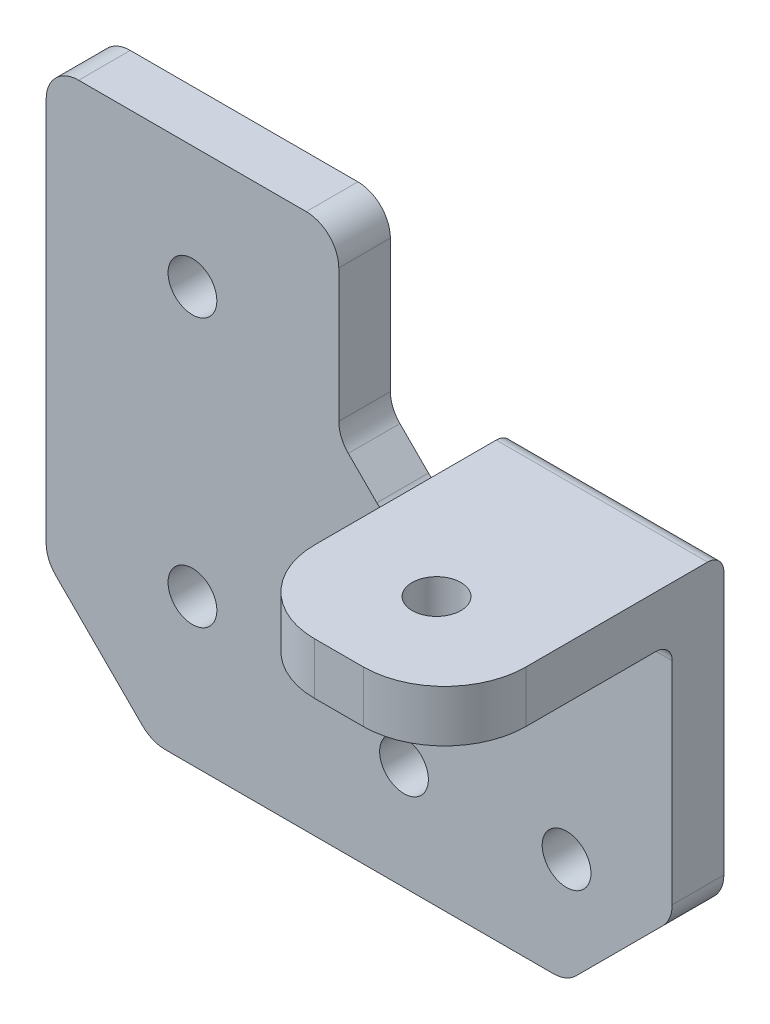
ISO-10303-21;
HEADER;
FILE_DESCRIPTION(('STEP AP214'),'2;1');
FILE_NAME('part.step','',(''),(''),'','','');
FILE_SCHEMA(('AUTOMOTIVE_DESIGN { 1 0 10303 214 1 1 1 1 }'));
ENDSEC;
DATA;
#1=APPLICATION_CONTEXT('core data for automotive mechanical design processes');
#2=APPLICATION_PROTOCOL_DEFINITION('international standard','automotive_design',2000,#1);
#3=PRODUCT_CONTEXT('',#1,'mechanical');
#4=PRODUCT('Part','Part','',(#3));
#5=PRODUCT_RELATED_PRODUCT_CATEGORY('part','',(#4));
#6=PRODUCT_DEFINITION_FORMATION('','',#4);
#7=PRODUCT_DEFINITION_CONTEXT('part definition',#1,'design');
#8=PRODUCT_DEFINITION('design','',#6,#7);
#9=PRODUCT_DEFINITION_SHAPE('','',#8);
#10=(LENGTH_UNIT() NAMED_UNIT(*) SI_UNIT(.MILLI.,.METRE.));
#11=(NAMED_UNIT(*) PLANE_ANGLE_UNIT() SI_UNIT($,.RADIAN.));
#12=(NAMED_UNIT(*) SI_UNIT($,.STERADIAN.) SOLID_ANGLE_UNIT());
#13=UNCERTAINTY_MEASURE_WITH_UNIT(LENGTH_MEASURE(1.E-05),#10,'distance_accuracy_value','');
#14=(GEOMETRIC_REPRESENTATION_CONTEXT(3) GLOBAL_UNCERTAINTY_ASSIGNED_CONTEXT((#13)) GLOBAL_UNIT_ASSIGNED_CONTEXT((#10,
#11,#12)) REPRESENTATION_CONTEXT('',''));
#15=CARTESIAN_POINT('',(0.,0.,0.));
#16=DIRECTION('',(0.,0.,1.));
#17=DIRECTION('',(1.,0.,0.));
#18=AXIS2_PLACEMENT_3D('',#15,#16,#17);
#19=CARTESIAN_POINT('',(6.5,0.,3.175));
#20=DIRECTION('',(1.,0.,0.));
#21=DIRECTION('',(0.,0.,-1.));
#22=AXIS2_PLACEMENT_3D('',#19,#20,#21);
#23=PLANE('',#22);
#24=DIRECTION('',(0.,-1.,0.));
#25=VECTOR('',#24,1.);
#26=CARTESIAN_POINT('',(6.5,0.,3.175));
#27=LINE('',#26,#25);
#28=CARTESIAN_POINT('',(6.5,13.825,3.175));
#29=VERTEX_POINT('',#28);
#30=CARTESIAN_POINT('',(6.5,0.82842712474619,3.175));
#31=VERTEX_POINT('',#30);
#32=EDGE_CURVE('E269',#29,#31,#27,.T.);
#33=ORIENTED_EDGE('',*,*,#32,.T.);
#34=DIRECTION('',(0.,0.,-1.));
#35=VECTOR('',#34,1.);
#36=CARTESIAN_POINT('',(6.5,0.82842712474619,0.));
#37=LINE('',#36,#35);
#38=CARTESIAN_POINT('',(6.5,0.82842712474619,0.));
#39=VERTEX_POINT('',#38);
#40=EDGE_CURVE('E374',#31,#39,#37,.T.);
#41=ORIENTED_EDGE('',*,*,#40,.T.);
#42=DIRECTION('',(0.,-1.,0.));
#43=VECTOR('',#42,1.);
#44=CARTESIAN_POINT('',(6.5,0.,0.));
#45=LINE('',#44,#43);
#46=CARTESIAN_POINT('',(6.5,17.,0.));
#47=VERTEX_POINT('',#46);
#48=EDGE_CURVE('E278',#47,#39,#45,.T.);
#49=ORIENTED_EDGE('',*,*,#48,.F.);
#50=CARTESIAN_POINT('',(6.5,17.,1.));
#51=DIRECTION('',(1.,0.,0.));
#52=DIRECTION('',(0.,0.,-1.));
#53=AXIS2_PLACEMENT_3D('',#50,#51,#52);
#54=CIRCLE('',#53,1.);
#55=CARTESIAN_POINT('',(6.5,18.,1.));
#56=VERTEX_POINT('',#55);
#57=EDGE_CURVE('E310',#47,#56,#54,.T.);
#58=ORIENTED_EDGE('',*,*,#57,.T.);
#59=DIRECTION('',(0.,0.,-1.));
#60=VECTOR('',#59,1.);
#61=CARTESIAN_POINT('',(6.5,18.,3.175));
#62=LINE('',#61,#60);
#63=CARTESIAN_POINT('',(6.5,18.,12.175));
#64=VERTEX_POINT('',#63);
#65=EDGE_CURVE('E287',#64,#56,#62,.T.);
#66=ORIENTED_EDGE('',*,*,#65,.F.);
#67=DIRECTION('',(0.,1.,0.));
#68=VECTOR('',#67,1.);
#69=CARTESIAN_POINT('',(6.5,0.,12.175));
#70=LINE('',#69,#68);
#71=CARTESIAN_POINT('',(6.5,14.825,12.175));
#72=VERTEX_POINT('',#71);
#73=EDGE_CURVE('E303',#64,#72,#70,.F.);
#74=ORIENTED_EDGE('',*,*,#73,.T.);
#75=DIRECTION('',(0.,0.,-1.));
#76=VECTOR('',#75,1.);
#77=CARTESIAN_POINT('',(6.5,14.825,17.175));
#78=LINE('',#77,#76);
#79=CARTESIAN_POINT('',(6.5,14.825,4.175));
#80=VERTEX_POINT('',#79);
#81=EDGE_CURVE('E250',#72,#80,#78,.T.);
#82=ORIENTED_EDGE('',*,*,#81,.T.);
#83=CARTESIAN_POINT('',(6.5,13.825,4.175));
#84=DIRECTION('',(1.,0.,0.));
#85=DIRECTION('',(0.,0.,-1.));
#86=AXIS2_PLACEMENT_3D('',#83,#84,#85);
#87=CIRCLE('',#86,1.);
#88=EDGE_CURVE('E328',#80,#29,#87,.F.);
#89=ORIENTED_EDGE('',*,*,#88,.T.);
#90=EDGE_LOOP('',(#33,#41,#49,#58,#66,#74,#82,#89));
#91=FACE_BOUND('',#90,.T.);
#92=ADVANCED_FACE('F41',(#91),#23,.T.);
#93=CARTESIAN_POINT('',(0.,18.,3.175));
#94=DIRECTION('',(0.,1.,0.));
#95=DIRECTION('',(0.,0.,1.));
#96=AXIS2_PLACEMENT_3D('',#93,#94,#95);
#97=PLANE('',#96);
#98=CARTESIAN_POINT('',(0.,18.,11.175));
#99=DIRECTION('',(0.,1.,0.));
#100=DIRECTION('',(0.,0.,1.));
#101=AXIS2_PLACEMENT_3D('',#98,#99,#100);
#102=CIRCLE('',#101,1.5);
#103=CARTESIAN_POINT('',(0.,18.,12.675));
#104=VERTEX_POINT('',#103);
#105=EDGE_CURVE('E253',#104,#104,#102,.T.);
#106=ORIENTED_EDGE('',*,*,#105,.F.);
#107=EDGE_LOOP('',(#106));
#108=FACE_BOUND('',#107,.T.);
#109=ORIENTED_EDGE('',*,*,#65,.T.);
#110=DIRECTION('',(1.,0.,0.));
#111=VECTOR('',#110,1.);
#112=CARTESIAN_POINT('',(-6.5,18.,1.));
#113=LINE('',#112,#111);
#114=CARTESIAN_POINT('',(-6.5,18.,1.));
#115=VERTEX_POINT('',#114);
#116=EDGE_CURVE('E313',#56,#115,#113,.F.);
#117=ORIENTED_EDGE('',*,*,#116,.T.);
#118=DIRECTION('',(0.,0.,-1.));
#119=VECTOR('',#118,1.);
#120=CARTESIAN_POINT('',(-6.5,18.,3.175));
#121=LINE('',#120,#119);
#122=CARTESIAN_POINT('',(-6.5,18.,12.175));
#123=VERTEX_POINT('',#122);
#124=EDGE_CURVE('E274',#123,#115,#121,.T.);
#125=ORIENTED_EDGE('',*,*,#124,.F.);
#126=CARTESIAN_POINT('',(-1.5,18.,12.175));
#127=DIRECTION('',(0.,1.,0.));
#128=DIRECTION('',(0.,0.,1.));
#129=AXIS2_PLACEMENT_3D('',#126,#127,#128);
#130=CIRCLE('',#129,5.);
#131=CARTESIAN_POINT('',(-1.5,18.,17.175));
#132=VERTEX_POINT('',#131);
#133=EDGE_CURVE('E300',#123,#132,#130,.T.);
#134=ORIENTED_EDGE('',*,*,#133,.T.);
#135=DIRECTION('',(-1.,0.,0.));
#136=VECTOR('',#135,1.);
#137=CARTESIAN_POINT('',(-6.5,18.,17.175));
#138=LINE('',#137,#136);
#139=CARTESIAN_POINT('',(1.5,18.,17.175));
#140=VERTEX_POINT('',#139);
#141=EDGE_CURVE('E238',#140,#132,#138,.T.);
#142=ORIENTED_EDGE('',*,*,#141,.F.);
#143=CARTESIAN_POINT('',(1.5,18.,12.175));
#144=DIRECTION('',(0.,1.,0.));
#145=DIRECTION('',(0.,0.,1.));
#146=AXIS2_PLACEMENT_3D('',#143,#144,#145);
#147=CIRCLE('',#146,5.);
#148=EDGE_CURVE('E297',#140,#64,#147,.T.);
#149=ORIENTED_EDGE('',*,*,#148,.T.);
#150=EDGE_LOOP('',(#109,#117,#125,#134,#142,#149));
#151=FACE_BOUND('',#150,.T.);
#152=ADVANCED_FACE('F573',(#108,#151),#97,.T.);
#153=CARTESIAN_POINT('',(0.,0.,3.175));
#154=DIRECTION('',(0.,0.,-1.));
#155=DIRECTION('',(-1.,0.,0.));
#156=AXIS2_PLACEMENT_3D('',#153,#154,#155);
#157=CYLINDRICAL_SURFACE('',#156,1.5);
#158=CARTESIAN_POINT('',(0.,0.,3.175));
#159=DIRECTION('',(0.,0.,1.));
#160=DIRECTION('',(1.,0.,0.));
#161=AXIS2_PLACEMENT_3D('',#158,#159,#160);
#162=CIRCLE('',#161,1.5);
#163=CARTESIAN_POINT('',(1.5,0.,3.175));
#164=VERTEX_POINT('',#163);
#165=EDGE_CURVE('E265',#164,#164,#162,.T.);
#166=ORIENTED_EDGE('',*,*,#165,.T.);
#167=EDGE_LOOP('',(#166));
#168=FACE_BOUND('',#167,.T.);
#169=CARTESIAN_POINT('',(0.,0.,0.));
#170=DIRECTION('',(0.,0.,1.));
#171=DIRECTION('',(1.,0.,0.));
#172=AXIS2_PLACEMENT_3D('',#169,#170,#171);
#173=CIRCLE('',#172,1.5);
#174=CARTESIAN_POINT('',(1.5,0.,0.));
#175=VERTEX_POINT('',#174);
#176=EDGE_CURVE('E264',#175,#175,#173,.T.);
#177=ORIENTED_EDGE('',*,*,#176,.F.);
#178=EDGE_LOOP('',(#177));
#179=FACE_BOUND('',#178,.T.);
#180=ADVANCED_FACE('F579',(#168,#179),#157,.F.);
#181=CARTESIAN_POINT('',(-6.5,0.,3.175));
#182=DIRECTION('',(-1.,0.,0.));
#183=DIRECTION('',(0.,0.,1.));
#184=AXIS2_PLACEMENT_3D('',#181,#182,#183);
#185=PLANE('',#184);
#186=DIRECTION('',(0.,1.,0.));
#187=VECTOR('',#186,1.);
#188=CARTESIAN_POINT('',(-6.5,0.,0.));
#189=LINE('',#188,#187);
#190=CARTESIAN_POINT('',(-6.5,16.3284271247462,0.));
#191=VERTEX_POINT('',#190);
#192=CARTESIAN_POINT('',(-6.5,17.,0.));
#193=VERTEX_POINT('',#192);
#194=EDGE_CURVE('E270',#191,#193,#189,.T.);
#195=ORIENTED_EDGE('',*,*,#194,.F.);
#196=DIRECTION('',(0.,0.,-1.));
#197=VECTOR('',#196,1.);
#198=CARTESIAN_POINT('',(-6.5,16.3284271247462,3.175));
#199=LINE('',#198,#197);
#200=CARTESIAN_POINT('',(-6.5,16.3284271247462,3.175));
#201=VERTEX_POINT('',#200);
#202=EDGE_CURVE('E348',#191,#201,#199,.F.);
#203=ORIENTED_EDGE('',*,*,#202,.T.);
#204=DIRECTION('',(0.,-1.,0.));
#205=VECTOR('',#204,1.);
#206=CARTESIAN_POINT('',(-6.5,0.,3.175));
#207=LINE('',#206,#205);
#208=CARTESIAN_POINT('',(-6.5,13.825,3.175));
#209=VERTEX_POINT('',#208);
#210=EDGE_CURVE('E334',#201,#209,#207,.T.);
#211=ORIENTED_EDGE('',*,*,#210,.T.);
#212=CARTESIAN_POINT('',(-6.5,13.825,4.175));
#213=DIRECTION('',(-1.,0.,0.));
#214=DIRECTION('',(0.,0.,1.));
#215=AXIS2_PLACEMENT_3D('',#212,#213,#214);
#216=CIRCLE('',#215,1.);
#217=CARTESIAN_POINT('',(-6.5,14.825,4.175));
#218=VERTEX_POINT('',#217);
#219=EDGE_CURVE('E331',#209,#218,#216,.F.);
#220=ORIENTED_EDGE('',*,*,#219,.T.);
#221=DIRECTION('',(0.,0.,-1.));
#222=VECTOR('',#221,1.);
#223=CARTESIAN_POINT('',(-6.5,14.825,17.175));
#224=LINE('',#223,#222);
#225=CARTESIAN_POINT('',(-6.5,14.825,12.175));
#226=VERTEX_POINT('',#225);
#227=EDGE_CURVE('E261',#226,#218,#224,.T.);
#228=ORIENTED_EDGE('',*,*,#227,.F.);
#229=DIRECTION('',(0.,-1.,0.));
#230=VECTOR('',#229,1.);
#231=CARTESIAN_POINT('',(-6.5,0.,12.175));
#232=LINE('',#231,#230);
#233=EDGE_CURVE('E222',#226,#123,#232,.F.);
#234=ORIENTED_EDGE('',*,*,#233,.T.);
#235=ORIENTED_EDGE('',*,*,#124,.T.);
#236=CARTESIAN_POINT('',(-6.5,17.,1.));
#237=DIRECTION('',(-1.,0.,0.));
#238=DIRECTION('',(0.,0.,1.));
#239=AXIS2_PLACEMENT_3D('',#236,#237,#238);
#240=CIRCLE('',#239,1.);
#241=EDGE_CURVE('E316',#115,#193,#240,.T.);
#242=ORIENTED_EDGE('',*,*,#241,.T.);
#243=EDGE_LOOP('',(#195,#203,#211,#220,#228,#234,#235,#242));
#244=FACE_BOUND('',#243,.T.);
#245=ADVANCED_FACE('F567',(#244),#185,.T.);
#246=CARTESIAN_POINT('',(0.,0.,3.175));
#247=DIRECTION('',(0.,0.,1.));
#248=DIRECTION('',(1.,0.,0.));
#249=AXIS2_PLACEMENT_3D('',#246,#247,#248);
#250=PLANE('',#249);
#251=CARTESIAN_POINT('',(-23.0129229130923,2.50000000000004,3.175));
#252=DIRECTION('',(0.,0.,-1.));
#253=DIRECTION('',(-1.,0.,0.));
#254=AXIS2_PLACEMENT_3D('',#251,#252,#253);
#255=CIRCLE('',#254,1.5);
#256=CARTESIAN_POINT('',(-24.5129229130923,2.50000000000004,3.175));
#257=VERTEX_POINT('',#256);
#258=EDGE_CURVE('E484',#257,#257,#255,.T.);
#259=ORIENTED_EDGE('',*,*,#258,.T.);
#260=EDGE_LOOP('',(#259));
#261=FACE_BOUND('',#260,.T.);
#262=CARTESIAN_POINT('',(-23.0129229130923,19.,3.175));
#263=DIRECTION('',(0.,0.,1.));
#264=DIRECTION('',(1.,0.,0.));
#265=AXIS2_PLACEMENT_3D('',#262,#263,#264);
#266=CIRCLE('',#265,1.5);
#267=CARTESIAN_POINT('',(-21.5129229130923,19.,3.175));
#268=VERTEX_POINT('',#267);
#269=EDGE_CURVE('E547',#268,#268,#266,.T.);
#270=ORIENTED_EDGE('',*,*,#269,.F.);
#271=EDGE_LOOP('',(#270));
#272=FACE_BOUND('',#271,.T.);
#273=DIRECTION('',(0.,1.,0.));
#274=VECTOR('',#273,1.);
#275=CARTESIAN_POINT('',(-32.0129229130922,0.,3.175));
#276=LINE('',#275,#274);
#277=CARTESIAN_POINT('',(-32.0129229130922,0.828427124746165,3.175));
#278=VERTEX_POINT('',#277);
#279=CARTESIAN_POINT('',(-32.0129229130922,24.5,3.175));
#280=VERTEX_POINT('',#279);
#281=EDGE_CURVE('E483',#278,#280,#276,.T.);
#282=ORIENTED_EDGE('',*,*,#281,.F.);
#283=CARTESIAN_POINT('',(-30.0129229130922,0.828427124746165,3.175));
#284=DIRECTION('',(0.,0.,1.));
#285=DIRECTION('',(1.,0.,0.));
#286=AXIS2_PLACEMENT_3D('',#283,#284,#285);
#287=CIRCLE('',#286,2.);
#288=CARTESIAN_POINT('',(-31.4271364754653,-0.585786437626929,3.175));
#289=VERTEX_POINT('',#288);
#290=EDGE_CURVE('E459',#278,#289,#287,.T.);
#291=ORIENTED_EDGE('',*,*,#290,.T.);
#292=DIRECTION('',(-0.707106781186547,0.707106781186548,0.));
#293=VECTOR('',#292,1.);
#294=CARTESIAN_POINT('',(-16.0064614565462,-16.0064614565461,3.175));
#295=LINE('',#294,#293);
#296=CARTESIAN_POINT('',(-26.0987093507192,-5.9142135623731,3.175));
#297=VERTEX_POINT('',#296);
#298=EDGE_CURVE('E448',#289,#297,#295,.F.);
#299=ORIENTED_EDGE('',*,*,#298,.T.);
#300=CARTESIAN_POINT('',(-24.6844957883461,-4.5,3.175));
#301=DIRECTION('',(0.,0.,1.));
#302=DIRECTION('',(1.,0.,0.));
#303=AXIS2_PLACEMENT_3D('',#300,#301,#302);
#304=CIRCLE('',#303,2.);
#305=CARTESIAN_POINT('',(-24.6844957883461,-6.5,3.175));
#306=VERTEX_POINT('',#305);
#307=EDGE_CURVE('E456',#297,#306,#304,.T.);
#308=ORIENTED_EDGE('',*,*,#307,.T.);
#309=DIRECTION('',(-1.,0.,0.));
#310=VECTOR('',#309,1.);
#311=CARTESIAN_POINT('',(0.,-6.5,3.175));
#312=LINE('',#311,#310);
#313=CARTESIAN_POINT('',(-0.82842712474619,-6.5,3.175));
#314=VERTEX_POINT('',#313);
#315=EDGE_CURVE('E494',#314,#306,#312,.T.);
#316=ORIENTED_EDGE('',*,*,#315,.F.);
#317=CARTESIAN_POINT('',(-0.82842712474619,-4.5,3.175));
#318=DIRECTION('',(0.,0.,1.));
#319=DIRECTION('',(1.,0.,0.));
#320=AXIS2_PLACEMENT_3D('',#317,#318,#319);
#321=CIRCLE('',#320,2.);
#322=CARTESIAN_POINT('',(0.585786437626904,-5.9142135623731,3.175));
#323=VERTEX_POINT('',#322);
#324=EDGE_CURVE('E371',#314,#323,#321,.T.);
#325=ORIENTED_EDGE('',*,*,#324,.T.);
#326=DIRECTION('',(-0.707106781186548,-0.707106781186548,0.));
#327=VECTOR('',#326,1.);
#328=CARTESIAN_POINT('',(3.25,-3.25,3.175));
#329=LINE('',#328,#327);
#330=CARTESIAN_POINT('',(5.9142135623731,-0.585786437626904,3.175));
#331=VERTEX_POINT('',#330);
#332=EDGE_CURVE('E520',#331,#323,#329,.T.);
#333=ORIENTED_EDGE('',*,*,#332,.F.);
#334=CARTESIAN_POINT('',(4.5,0.82842712474619,3.175));
#335=DIRECTION('',(0.,0.,1.));
#336=DIRECTION('',(1.,0.,0.));
#337=AXIS2_PLACEMENT_3D('',#334,#335,#336);
#338=CIRCLE('',#337,2.);
#339=EDGE_CURVE('E368',#331,#31,#338,.T.);
#340=ORIENTED_EDGE('',*,*,#339,.T.);
#341=ORIENTED_EDGE('',*,*,#32,.F.);
#342=DIRECTION('',(1.,0.,0.));
#343=VECTOR('',#342,1.);
#344=CARTESIAN_POINT('',(0.,13.825,3.175));
#345=LINE('',#344,#343);
#346=EDGE_CURVE('E324',#29,#209,#345,.F.);
#347=ORIENTED_EDGE('',*,*,#346,.T.);
#348=ORIENTED_EDGE('',*,*,#210,.F.);
#349=CARTESIAN_POINT('',(-8.5,16.3284271247462,3.175));
#350=DIRECTION('',(0.,0.,1.));
#351=DIRECTION('',(1.,0.,0.));
#352=AXIS2_PLACEMENT_3D('',#349,#350,#351);
#353=CIRCLE('',#352,2.);
#354=CARTESIAN_POINT('',(-7.08578643762691,14.9142135623731,3.175));
#355=VERTEX_POINT('',#354);
#356=EDGE_CURVE('E378',#201,#355,#353,.F.);
#357=ORIENTED_EDGE('',*,*,#356,.T.);
#358=DIRECTION('',(0.707106781186551,0.707106781186544,0.));
#359=VECTOR('',#358,1.);
#360=CARTESIAN_POINT('',(-10.5,11.5,3.175));
#361=LINE('',#360,#359);
#362=CARTESIAN_POINT('',(-8.84224789417304,13.157752105827,3.175));
#363=VERTEX_POINT('',#362);
#364=EDGE_CURVE('E340',#355,#363,#361,.F.);
#365=ORIENTED_EDGE('',*,*,#364,.T.);
#366=CARTESIAN_POINT('',(-10.2564614565461,14.5719656682001,3.175));
#367=DIRECTION('',(0.,0.,1.));
#368=DIRECTION('',(1.,0.,0.));
#369=AXIS2_PLACEMENT_3D('',#366,#367,#368);
#370=CIRCLE('',#369,2.);
#371=CARTESIAN_POINT('',(-11.6706750189192,13.157752105827,3.175));
#372=VERTEX_POINT('',#371);
#373=EDGE_CURVE('E439',#363,#372,#370,.F.);
#374=ORIENTED_EDGE('',*,*,#373,.T.);
#375=DIRECTION('',(-0.707106781186551,0.707106781186544,0.));
#376=VECTOR('',#375,1.);
#377=CARTESIAN_POINT('',(-10.0129229130922,11.5,3.175));
#378=LINE('',#377,#376);
#379=CARTESIAN_POINT('',(-13.4271364754654,14.9142135623732,3.175));
#380=VERTEX_POINT('',#379);
#381=EDGE_CURVE('E384',#372,#380,#378,.T.);
#382=ORIENTED_EDGE('',*,*,#381,.T.);
#383=CARTESIAN_POINT('',(-12.0129229130923,16.3284271247463,3.175));
#384=DIRECTION('',(0.,0.,1.));
#385=DIRECTION('',(1.,0.,0.));
#386=AXIS2_PLACEMENT_3D('',#383,#384,#385);
#387=CIRCLE('',#386,2.);
#388=CARTESIAN_POINT('',(-14.0129229130923,16.3284271247463,3.175));
#389=VERTEX_POINT('',#388);
#390=EDGE_CURVE('E436',#380,#389,#387,.F.);
#391=ORIENTED_EDGE('',*,*,#390,.T.);
#392=DIRECTION('',(0.,1.,0.));
#393=VECTOR('',#392,1.);
#394=CARTESIAN_POINT('',(-14.0129229130923,0.,3.175));
#395=LINE('',#394,#393);
#396=CARTESIAN_POINT('',(-14.0129229130923,24.5,3.175));
#397=VERTEX_POINT('',#396);
#398=EDGE_CURVE('E539',#389,#397,#395,.T.);
#399=ORIENTED_EDGE('',*,*,#398,.T.);
#400=CARTESIAN_POINT('',(-16.0129229130923,24.5,3.175));
#401=DIRECTION('',(0.,0.,1.));
#402=DIRECTION('',(1.,0.,0.));
#403=AXIS2_PLACEMENT_3D('',#400,#401,#402);
#404=CIRCLE('',#403,2.);
#405=CARTESIAN_POINT('',(-16.0129229130923,26.5,3.175));
#406=VERTEX_POINT('',#405);
#407=EDGE_CURVE('E409',#397,#406,#404,.T.);
#408=ORIENTED_EDGE('',*,*,#407,.T.);
#409=DIRECTION('',(-1.,0.,0.));
#410=VECTOR('',#409,1.);
#411=CARTESIAN_POINT('',(0.,26.5,3.175));
#412=LINE('',#411,#410);
#413=CARTESIAN_POINT('',(-30.0129229130922,26.5,3.175));
#414=VERTEX_POINT('',#413);
#415=EDGE_CURVE('E543',#406,#414,#412,.T.);
#416=ORIENTED_EDGE('',*,*,#415,.T.);
#417=CARTESIAN_POINT('',(-30.0129229130922,24.5,3.175));
#418=DIRECTION('',(0.,0.,1.));
#419=DIRECTION('',(1.,0.,0.));
#420=AXIS2_PLACEMENT_3D('',#417,#418,#419);
#421=CIRCLE('',#420,2.);
#422=EDGE_CURVE('E412',#414,#280,#421,.T.);
#423=ORIENTED_EDGE('',*,*,#422,.T.);
#424=EDGE_LOOP('',(#282,#291,#299,#308,#316,#325,#333,#340,#341,#347,#348,#357,#365,#374,#382,
#391,#399,#408,#416,#423));
#425=FACE_BOUND('',#424,.T.);
#426=CARTESIAN_POINT('',(-10.,0.,3.175));
#427=DIRECTION('',(0.,0.,1.));
#428=DIRECTION('',(1.,0.,0.));
#429=AXIS2_PLACEMENT_3D('',#426,#427,#428);
#430=CIRCLE('',#429,1.5);
#431=CARTESIAN_POINT('',(-8.5,0.,3.175));
#432=VERTEX_POINT('',#431);
#433=EDGE_CURVE('E510',#432,#432,#430,.F.);
#434=ORIENTED_EDGE('',*,*,#433,.T.);
#435=EDGE_LOOP('',(#434));
#436=FACE_BOUND('',#435,.T.);
#437=ORIENTED_EDGE('',*,*,#165,.F.);
#438=EDGE_LOOP('',(#437));
#439=FACE_BOUND('',#438,.T.);
#440=ADVANCED_FACE('F488',(#261,#272,#425,#436,#439),#250,.T.);
#441=CARTESIAN_POINT('',(0.,0.,0.));
#442=DIRECTION('',(0.,0.,1.));
#443=DIRECTION('',(1.,0.,0.));
#444=AXIS2_PLACEMENT_3D('',#441,#442,#443);
#445=PLANE('',#444);
#446=CARTESIAN_POINT('',(-23.0129229130923,2.50000000000004,0.));
#447=DIRECTION('',(0.,0.,-1.));
#448=DIRECTION('',(-1.,0.,0.));
#449=AXIS2_PLACEMENT_3D('',#446,#447,#448);
#450=CIRCLE('',#449,1.5);
#451=CARTESIAN_POINT('',(-24.5129229130923,2.50000000000004,0.));
#452=VERTEX_POINT('',#451);
#453=EDGE_CURVE('E516',#452,#452,#450,.T.);
#454=ORIENTED_EDGE('',*,*,#453,.F.);
#455=EDGE_LOOP('',(#454));
#456=FACE_BOUND('',#455,.T.);
#457=CARTESIAN_POINT('',(-23.0129229130923,19.,0.));
#458=DIRECTION('',(0.,0.,-1.));
#459=DIRECTION('',(-1.,0.,0.));
#460=AXIS2_PLACEMENT_3D('',#457,#458,#459);
#461=CIRCLE('',#460,1.5);
#462=CARTESIAN_POINT('',(-24.5129229130923,19.,0.));
#463=VERTEX_POINT('',#462);
#464=EDGE_CURVE('E551',#463,#463,#461,.T.);
#465=ORIENTED_EDGE('',*,*,#464,.F.);
#466=EDGE_LOOP('',(#465));
#467=FACE_BOUND('',#466,.T.);
#468=DIRECTION('',(0.707106781186547,-0.707106781186548,0.));
#469=VECTOR('',#468,1.);
#470=CARTESIAN_POINT('',(-25.5129229130923,-6.5,0.));
#471=LINE('',#470,#469);
#472=CARTESIAN_POINT('',(-26.0987093507192,-5.91421356237309,0.));
#473=VERTEX_POINT('',#472);
#474=CARTESIAN_POINT('',(-31.4271364754653,-0.585786437626929,0.));
#475=VERTEX_POINT('',#474);
#476=EDGE_CURVE('E445',#473,#475,#471,.F.);
#477=ORIENTED_EDGE('',*,*,#476,.T.);
#478=CARTESIAN_POINT('',(-30.0129229130922,0.828427124746165,0.));
#479=DIRECTION('',(0.,0.,1.));
#480=DIRECTION('',(1.,0.,0.));
#481=AXIS2_PLACEMENT_3D('',#478,#479,#480);
#482=CIRCLE('',#481,2.);
#483=CARTESIAN_POINT('',(-32.0129229130922,0.828427124746165,0.));
#484=VERTEX_POINT('',#483);
#485=EDGE_CURVE('E50',#475,#484,#482,.F.);
#486=ORIENTED_EDGE('',*,*,#485,.T.);
#487=DIRECTION('',(0.,1.,0.));
#488=VECTOR('',#487,1.);
#489=CARTESIAN_POINT('',(-32.0129229130922,0.,0.));
#490=LINE('',#489,#488);
#491=CARTESIAN_POINT('',(-32.0129229130922,24.5,0.));
#492=VERTEX_POINT('',#491);
#493=EDGE_CURVE('E474',#484,#492,#490,.T.);
#494=ORIENTED_EDGE('',*,*,#493,.T.);
#495=CARTESIAN_POINT('',(-30.0129229130922,24.5,0.));
#496=DIRECTION('',(0.,0.,1.));
#497=DIRECTION('',(1.,0.,0.));
#498=AXIS2_PLACEMENT_3D('',#495,#496,#497);
#499=CIRCLE('',#498,2.);
#500=CARTESIAN_POINT('',(-30.0129229130922,26.5,0.));
#501=VERTEX_POINT('',#500);
#502=EDGE_CURVE('E399',#492,#501,#499,.F.);
#503=ORIENTED_EDGE('',*,*,#502,.T.);
#504=DIRECTION('',(-1.,0.,0.));
#505=VECTOR('',#504,1.);
#506=CARTESIAN_POINT('',(0.,26.5,0.));
#507=LINE('',#506,#505);
#508=CARTESIAN_POINT('',(-16.0129229130923,26.5,0.));
#509=VERTEX_POINT('',#508);
#510=EDGE_CURVE('E535',#509,#501,#507,.T.);
#511=ORIENTED_EDGE('',*,*,#510,.F.);
#512=CARTESIAN_POINT('',(-16.0129229130923,24.5,0.));
#513=DIRECTION('',(0.,0.,1.));
#514=DIRECTION('',(1.,0.,0.));
#515=AXIS2_PLACEMENT_3D('',#512,#513,#514);
#516=CIRCLE('',#515,2.);
#517=CARTESIAN_POINT('',(-14.0129229130923,24.5,0.));
#518=VERTEX_POINT('',#517);
#519=EDGE_CURVE('E396',#509,#518,#516,.F.);
#520=ORIENTED_EDGE('',*,*,#519,.T.);
#521=DIRECTION('',(0.,1.,0.));
#522=VECTOR('',#521,1.);
#523=CARTESIAN_POINT('',(-14.0129229130923,0.,0.));
#524=LINE('',#523,#522);
#525=CARTESIAN_POINT('',(-14.0129229130923,16.3284271247463,0.));
#526=VERTEX_POINT('',#525);
#527=EDGE_CURVE('E531',#526,#518,#524,.T.);
#528=ORIENTED_EDGE('',*,*,#527,.F.);
#529=CARTESIAN_POINT('',(-12.0129229130923,16.3284271247463,0.));
#530=DIRECTION('',(0.,0.,1.));
#531=DIRECTION('',(1.,0.,0.));
#532=AXIS2_PLACEMENT_3D('',#529,#530,#531);
#533=CIRCLE('',#532,2.);
#534=CARTESIAN_POINT('',(-13.4271364754654,14.9142135623732,0.));
#535=VERTEX_POINT('',#534);
#536=EDGE_CURVE('E433',#526,#535,#533,.T.);
#537=ORIENTED_EDGE('',*,*,#536,.T.);
#538=DIRECTION('',(0.707106781186551,-0.707106781186544,0.));
#539=VECTOR('',#538,1.);
#540=CARTESIAN_POINT('',(0.743538543453953,0.743538543453961,0.));
#541=LINE('',#540,#539);
#542=CARTESIAN_POINT('',(-11.6706750189192,13.157752105827,0.));
#543=VERTEX_POINT('',#542);
#544=EDGE_CURVE('E388',#535,#543,#541,.T.);
#545=ORIENTED_EDGE('',*,*,#544,.T.);
#546=CARTESIAN_POINT('',(-10.2564614565461,14.5719656682001,0.));
#547=DIRECTION('',(0.,0.,1.));
#548=DIRECTION('',(1.,0.,0.));
#549=AXIS2_PLACEMENT_3D('',#546,#547,#548);
#550=CIRCLE('',#549,2.);
#551=CARTESIAN_POINT('',(-8.84224789417304,13.157752105827,0.));
#552=VERTEX_POINT('',#551);
#553=EDGE_CURVE('E442',#543,#552,#550,.T.);
#554=ORIENTED_EDGE('',*,*,#553,.T.);
#555=DIRECTION('',(-0.707106781186551,-0.707106781186544,0.));
#556=VECTOR('',#555,1.);
#557=CARTESIAN_POINT('',(-11.,11.0000000000001,0.));
#558=LINE('',#557,#556);
#559=CARTESIAN_POINT('',(-7.08578643762691,14.9142135623731,0.));
#560=VERTEX_POINT('',#559);
#561=EDGE_CURVE('E337',#552,#560,#558,.F.);
#562=ORIENTED_EDGE('',*,*,#561,.T.);
#563=CARTESIAN_POINT('',(-8.5,16.3284271247462,0.));
#564=DIRECTION('',(0.,0.,1.));
#565=DIRECTION('',(1.,0.,0.));
#566=AXIS2_PLACEMENT_3D('',#563,#564,#565);
#567=CIRCLE('',#566,2.);
#568=EDGE_CURVE('E381',#560,#191,#567,.T.);
#569=ORIENTED_EDGE('',*,*,#568,.T.);
#570=ORIENTED_EDGE('',*,*,#194,.T.);
#571=DIRECTION('',(1.,0.,0.));
#572=VECTOR('',#571,1.);
#573=CARTESIAN_POINT('',(6.5,17.,0.));
#574=LINE('',#573,#572);
#575=EDGE_CURVE('E306',#193,#47,#574,.T.);
#576=ORIENTED_EDGE('',*,*,#575,.T.);
#577=ORIENTED_EDGE('',*,*,#48,.T.);
#578=CARTESIAN_POINT('',(4.5,0.82842712474619,0.));
#579=DIRECTION('',(0.,0.,1.));
#580=DIRECTION('',(1.,0.,0.));
#581=AXIS2_PLACEMENT_3D('',#578,#579,#580);
#582=CIRCLE('',#581,2.);
#583=CARTESIAN_POINT('',(5.9142135623731,-0.585786437626905,0.));
#584=VERTEX_POINT('',#583);
#585=EDGE_CURVE('E359',#39,#584,#582,.F.);
#586=ORIENTED_EDGE('',*,*,#585,.T.);
#587=DIRECTION('',(0.707106781186548,0.707106781186548,0.));
#588=VECTOR('',#587,1.);
#589=CARTESIAN_POINT('',(6.5,0.,0.));
#590=LINE('',#589,#588);
#591=CARTESIAN_POINT('',(0.585786437626904,-5.9142135623731,0.));
#592=VERTEX_POINT('',#591);
#593=EDGE_CURVE('E527',#592,#584,#590,.T.);
#594=ORIENTED_EDGE('',*,*,#593,.F.);
#595=CARTESIAN_POINT('',(-0.82842712474619,-4.5,0.));
#596=DIRECTION('',(0.,0.,1.));
#597=DIRECTION('',(1.,0.,0.));
#598=AXIS2_PLACEMENT_3D('',#595,#596,#597);
#599=CIRCLE('',#598,2.);
#600=CARTESIAN_POINT('',(-0.82842712474619,-6.5,0.));
#601=VERTEX_POINT('',#600);
#602=EDGE_CURVE('E362',#592,#601,#599,.F.);
#603=ORIENTED_EDGE('',*,*,#602,.T.);
#604=DIRECTION('',(-1.,0.,0.));
#605=VECTOR('',#604,1.);
#606=CARTESIAN_POINT('',(0.,-6.5,0.));
#607=LINE('',#606,#605);
#608=CARTESIAN_POINT('',(-24.6844957883461,-6.5,0.));
#609=VERTEX_POINT('',#608);
#610=EDGE_CURVE('E506',#601,#609,#607,.T.);
#611=ORIENTED_EDGE('',*,*,#610,.T.);
#612=CARTESIAN_POINT('',(-24.6844957883461,-4.5,0.));
#613=DIRECTION('',(0.,0.,1.));
#614=DIRECTION('',(1.,0.,0.));
#615=AXIS2_PLACEMENT_3D('',#612,#613,#614);
#616=CIRCLE('',#615,2.);
#617=EDGE_CURVE('E57',#609,#473,#616,.F.);
#618=ORIENTED_EDGE('',*,*,#617,.T.);
#619=EDGE_LOOP('',(#477,#486,#494,#503,#511,#520,#528,#537,#545,#554,#562,#569,#570,#576,#577,
#586,#594,#603,#611,#618));
#620=FACE_BOUND('',#619,.T.);
#621=ORIENTED_EDGE('',*,*,#176,.T.);
#622=EDGE_LOOP('',(#621));
#623=FACE_BOUND('',#622,.T.);
#624=CARTESIAN_POINT('',(-10.,0.,0.));
#625=DIRECTION('',(0.,0.,-1.));
#626=DIRECTION('',(-1.,0.,0.));
#627=AXIS2_PLACEMENT_3D('',#624,#625,#626);
#628=CIRCLE('',#627,1.5);
#629=CARTESIAN_POINT('',(-11.5,0.,0.));
#630=VERTEX_POINT('',#629);
#631=EDGE_CURVE('E502',#630,#630,#628,.T.);
#632=ORIENTED_EDGE('',*,*,#631,.F.);
#633=EDGE_LOOP('',(#632));
#634=FACE_BOUND('',#633,.T.);
#635=ADVANCED_FACE('F472',(#456,#467,#620,#623,#634),#445,.F.);
#636=CARTESIAN_POINT('',(-6.5,14.825,17.175));
#637=DIRECTION('',(0.,1.,0.));
#638=DIRECTION('',(0.,0.,1.));
#639=AXIS2_PLACEMENT_3D('',#636,#637,#638);
#640=PLANE('',#639);
#641=CARTESIAN_POINT('',(0.,14.825,11.175));
#642=DIRECTION('',(0.,1.,0.));
#643=DIRECTION('',(0.,0.,1.));
#644=AXIS2_PLACEMENT_3D('',#641,#642,#643);
#645=CIRCLE('',#644,1.5);
#646=CARTESIAN_POINT('',(0.,14.825,12.675));
#647=VERTEX_POINT('',#646);
#648=EDGE_CURVE('E246',#647,#647,#645,.T.);
#649=ORIENTED_EDGE('',*,*,#648,.T.);
#650=EDGE_LOOP('',(#649));
#651=FACE_BOUND('',#650,.T.);
#652=ORIENTED_EDGE('',*,*,#227,.T.);
#653=DIRECTION('',(1.,0.,0.));
#654=VECTOR('',#653,1.);
#655=CARTESIAN_POINT('',(-6.5,14.825,4.175));
#656=LINE('',#655,#654);
#657=EDGE_CURVE('E320',#218,#80,#656,.T.);
#658=ORIENTED_EDGE('',*,*,#657,.T.);
#659=ORIENTED_EDGE('',*,*,#81,.F.);
#660=CARTESIAN_POINT('',(1.5,14.825,12.175));
#661=DIRECTION('',(0.,1.,0.));
#662=DIRECTION('',(0.,0.,1.));
#663=AXIS2_PLACEMENT_3D('',#660,#661,#662);
#664=CIRCLE('',#663,5.);
#665=CARTESIAN_POINT('',(1.5,14.825,17.175));
#666=VERTEX_POINT('',#665);
#667=EDGE_CURVE('E228',#72,#666,#664,.F.);
#668=ORIENTED_EDGE('',*,*,#667,.T.);
#669=DIRECTION('',(1.,0.,0.));
#670=VECTOR('',#669,1.);
#671=CARTESIAN_POINT('',(-6.5,14.825,17.175));
#672=LINE('',#671,#670);
#673=CARTESIAN_POINT('',(-1.5,14.825,17.175));
#674=VERTEX_POINT('',#673);
#675=EDGE_CURVE('E235',#674,#666,#672,.T.);
#676=ORIENTED_EDGE('',*,*,#675,.F.);
#677=CARTESIAN_POINT('',(-1.5,14.825,12.175));
#678=DIRECTION('',(0.,1.,0.));
#679=DIRECTION('',(0.,0.,1.));
#680=AXIS2_PLACEMENT_3D('',#677,#678,#679);
#681=CIRCLE('',#680,5.);
#682=EDGE_CURVE('E217',#674,#226,#681,.F.);
#683=ORIENTED_EDGE('',*,*,#682,.T.);
#684=EDGE_LOOP('',(#652,#658,#659,#668,#676,#683));
#685=FACE_BOUND('',#684,.T.);
#686=ADVANCED_FACE('F242',(#651,#685),#640,.F.);
#687=CARTESIAN_POINT('',(0.,0.,17.175));
#688=DIRECTION('',(0.,0.,1.));
#689=DIRECTION('',(1.,0.,0.));
#690=AXIS2_PLACEMENT_3D('',#687,#688,#689);
#691=PLANE('',#690);
#692=ORIENTED_EDGE('',*,*,#141,.T.);
#693=DIRECTION('',(0.,-1.,0.));
#694=VECTOR('',#693,1.);
#695=CARTESIAN_POINT('',(-1.5,0.,17.175));
#696=LINE('',#695,#694);
#697=EDGE_CURVE('E221',#132,#674,#696,.T.);
#698=ORIENTED_EDGE('',*,*,#697,.T.);
#699=ORIENTED_EDGE('',*,*,#675,.T.);
#700=DIRECTION('',(0.,1.,0.));
#701=VECTOR('',#700,1.);
#702=CARTESIAN_POINT('',(1.5,0.,17.175));
#703=LINE('',#702,#701);
#704=EDGE_CURVE('E240',#666,#140,#703,.T.);
#705=ORIENTED_EDGE('',*,*,#704,.T.);
#706=EDGE_LOOP('',(#692,#698,#699,#705));
#707=FACE_BOUND('',#706,.T.);
#708=ADVANCED_FACE('F233',(#707),#691,.T.);
#709=CARTESIAN_POINT('',(0.,0.,11.175));
#710=DIRECTION('',(0.,1.,0.));
#711=DIRECTION('',(0.,0.,1.));
#712=AXIS2_PLACEMENT_3D('',#709,#710,#711);
#713=CYLINDRICAL_SURFACE('',#712,1.5);
#714=ORIENTED_EDGE('',*,*,#105,.T.);
#715=EDGE_LOOP('',(#714));
#716=FACE_BOUND('',#715,.T.);
#717=ORIENTED_EDGE('',*,*,#648,.F.);
#718=EDGE_LOOP('',(#717));
#719=FACE_BOUND('',#718,.T.);
#720=ADVANCED_FACE('F589',(#716,#719),#713,.F.);
#721=CARTESIAN_POINT('',(-1.5,0.,12.175));
#722=DIRECTION('',(0.,-1.,0.));
#723=DIRECTION('',(0.,0.,-1.));
#724=AXIS2_PLACEMENT_3D('',#721,#722,#723);
#725=CYLINDRICAL_SURFACE('',#724,5.);
#726=ORIENTED_EDGE('',*,*,#133,.F.);
#727=ORIENTED_EDGE('',*,*,#233,.F.);
#728=ORIENTED_EDGE('',*,*,#682,.F.);
#729=ORIENTED_EDGE('',*,*,#697,.F.);
#730=EDGE_LOOP('',(#726,#727,#728,#729));
#731=FACE_BOUND('',#730,.T.);
#732=ADVANCED_FACE('F220',(#731),#725,.T.);
#733=CARTESIAN_POINT('',(1.5,0.,12.175));
#734=DIRECTION('',(0.,1.,0.));
#735=DIRECTION('',(0.,0.,1.));
#736=AXIS2_PLACEMENT_3D('',#733,#734,#735);
#737=CYLINDRICAL_SURFACE('',#736,5.);
#738=ORIENTED_EDGE('',*,*,#667,.F.);
#739=ORIENTED_EDGE('',*,*,#73,.F.);
#740=ORIENTED_EDGE('',*,*,#148,.F.);
#741=ORIENTED_EDGE('',*,*,#704,.F.);
#742=EDGE_LOOP('',(#738,#739,#740,#741));
#743=FACE_BOUND('',#742,.T.);
#744=ADVANCED_FACE('F588',(#743),#737,.T.);
#745=CARTESIAN_POINT('',(0.,-6.5,24.1809515376));
#746=DIRECTION('',(0.,-1.,0.));
#747=DIRECTION('',(0.,0.,-1.));
#748=AXIS2_PLACEMENT_3D('',#745,#746,#747);
#749=PLANE('',#748);
#750=ORIENTED_EDGE('',*,*,#315,.T.);
#751=DIRECTION('',(0.,0.,1.));
#752=VECTOR('',#751,1.);
#753=CARTESIAN_POINT('',(-24.6844957883461,-6.5,24.1809515376));
#754=LINE('',#753,#752);
#755=EDGE_CURVE('E11',#306,#609,#754,.F.);
#756=ORIENTED_EDGE('',*,*,#755,.T.);
#757=ORIENTED_EDGE('',*,*,#610,.F.);
#758=DIRECTION('',(0.,0.,-1.));
#759=VECTOR('',#758,1.);
#760=CARTESIAN_POINT('',(-0.82842712474619,-6.5,3.175));
#761=LINE('',#760,#759);
#762=EDGE_CURVE('E365',#601,#314,#761,.F.);
#763=ORIENTED_EDGE('',*,*,#762,.T.);
#764=EDGE_LOOP('',(#750,#756,#757,#763));
#765=FACE_BOUND('',#764,.T.);
#766=ADVANCED_FACE('F497',(#765),#749,.T.);
#767=CARTESIAN_POINT('',(-10.,0.,24.1809515376));
#768=DIRECTION('',(0.,0.,-1.));
#769=DIRECTION('',(-1.,0.,0.));
#770=AXIS2_PLACEMENT_3D('',#767,#768,#769);
#771=CYLINDRICAL_SURFACE('',#770,1.5);
#772=ORIENTED_EDGE('',*,*,#631,.T.);
#773=EDGE_LOOP('',(#772));
#774=FACE_BOUND('',#773,.T.);
#775=ORIENTED_EDGE('',*,*,#433,.F.);
#776=EDGE_LOOP('',(#775));
#777=FACE_BOUND('',#776,.T.);
#778=ADVANCED_FACE('F597',(#774,#777),#771,.F.);
#779=CARTESIAN_POINT('',(0.,17.,1.));
#780=DIRECTION('',(-1.,0.,0.));
#781=DIRECTION('',(0.,0.,1.));
#782=AXIS2_PLACEMENT_3D('',#779,#780,#781);
#783=CYLINDRICAL_SURFACE('',#782,1.);
#784=ORIENTED_EDGE('',*,*,#241,.F.);
#785=ORIENTED_EDGE('',*,*,#116,.F.);
#786=ORIENTED_EDGE('',*,*,#57,.F.);
#787=ORIENTED_EDGE('',*,*,#575,.F.);
#788=EDGE_LOOP('',(#784,#785,#786,#787));
#789=FACE_BOUND('',#788,.T.);
#790=ADVANCED_FACE('F593',(#789),#783,.T.);
#791=CARTESIAN_POINT('',(-6.5,13.825,4.175));
#792=DIRECTION('',(1.,0.,0.));
#793=DIRECTION('',(0.,0.,-1.));
#794=AXIS2_PLACEMENT_3D('',#791,#792,#793);
#795=CYLINDRICAL_SURFACE('',#794,1.);
#796=ORIENTED_EDGE('',*,*,#219,.F.);
#797=ORIENTED_EDGE('',*,*,#346,.F.);
#798=ORIENTED_EDGE('',*,*,#88,.F.);
#799=ORIENTED_EDGE('',*,*,#657,.F.);
#800=EDGE_LOOP('',(#796,#797,#798,#799));
#801=FACE_BOUND('',#800,.T.);
#802=ADVANCED_FACE('F596',(#801),#795,.F.);
#803=CARTESIAN_POINT('',(-32.0129229130922,0.,3.175));
#804=DIRECTION('',(-1.,0.,0.));
#805=DIRECTION('',(0.,0.,1.));
#806=AXIS2_PLACEMENT_3D('',#803,#804,#805);
#807=PLANE('',#806);
#808=ORIENTED_EDGE('',*,*,#493,.F.);
#809=DIRECTION('',(0.,0.,-1.));
#810=VECTOR('',#809,1.);
#811=CARTESIAN_POINT('',(-32.0129229130922,0.828427124746165,3.175));
#812=LINE('',#811,#810);
#813=EDGE_CURVE('E452',#484,#278,#812,.F.);
#814=ORIENTED_EDGE('',*,*,#813,.T.);
#815=ORIENTED_EDGE('',*,*,#281,.T.);
#816=DIRECTION('',(0.,0.,-1.));
#817=VECTOR('',#816,1.);
#818=CARTESIAN_POINT('',(-32.0129229130922,24.5,0.));
#819=LINE('',#818,#817);
#820=EDGE_CURVE('E392',#280,#492,#819,.T.);
#821=ORIENTED_EDGE('',*,*,#820,.T.);
#822=EDGE_LOOP('',(#808,#814,#815,#821));
#823=FACE_BOUND('',#822,.T.);
#824=ADVANCED_FACE('F479',(#823),#807,.T.);
#825=CARTESIAN_POINT('',(-23.0129229130923,2.50000000000004,3.175));
#826=DIRECTION('',(0.,0.,-1.));
#827=DIRECTION('',(-1.,0.,0.));
#828=AXIS2_PLACEMENT_3D('',#825,#826,#827);
#829=CYLINDRICAL_SURFACE('',#828,1.5);
#830=ORIENTED_EDGE('',*,*,#258,.F.);
#831=EDGE_LOOP('',(#830));
#832=FACE_BOUND('',#831,.T.);
#833=ORIENTED_EDGE('',*,*,#453,.T.);
#834=EDGE_LOOP('',(#833));
#835=FACE_BOUND('',#834,.T.);
#836=ADVANCED_FACE('F606',(#832,#835),#829,.F.);
#837=CARTESIAN_POINT('',(-10.5,11.5,3.175));
#838=DIRECTION('',(-0.707106781186544,0.707106781186551,0.));
#839=DIRECTION('',(0.,0.,1.));
#840=AXIS2_PLACEMENT_3D('',#837,#838,#839);
#841=PLANE('',#840);
#842=ORIENTED_EDGE('',*,*,#561,.F.);
#843=DIRECTION('',(0.,0.,1.));
#844=VECTOR('',#843,1.);
#845=CARTESIAN_POINT('',(-8.84224789417304,13.157752105827,3.175));
#846=LINE('',#845,#844);
#847=EDGE_CURVE('E429',#552,#363,#846,.T.);
#848=ORIENTED_EDGE('',*,*,#847,.T.);
#849=ORIENTED_EDGE('',*,*,#364,.F.);
#850=DIRECTION('',(0.,0.,1.));
#851=VECTOR('',#850,1.);
#852=CARTESIAN_POINT('',(-7.08578643762691,14.9142135623731,3.175));
#853=LINE('',#852,#851);
#854=EDGE_CURVE('E344',#355,#560,#853,.F.);
#855=ORIENTED_EDGE('',*,*,#854,.T.);
#856=EDGE_LOOP('',(#842,#848,#849,#855));
#857=FACE_BOUND('',#856,.T.);
#858=ADVANCED_FACE('F602',(#857),#841,.T.);
#859=CARTESIAN_POINT('',(6.5,0.,10.));
#860=DIRECTION('',(-0.707106781186548,0.707106781186548,0.));
#861=DIRECTION('',(-0.707106781186548,-0.707106781186548,0.));
#862=AXIS2_PLACEMENT_3D('',#859,#860,#861);
#863=PLANE('',#862);
#864=ORIENTED_EDGE('',*,*,#332,.T.);
#865=DIRECTION('',(0.,0.,-1.));
#866=VECTOR('',#865,1.);
#867=CARTESIAN_POINT('',(0.585786437626905,-5.9142135623731,0.));
#868=LINE('',#867,#866);
#869=EDGE_CURVE('E355',#323,#592,#868,.T.);
#870=ORIENTED_EDGE('',*,*,#869,.T.);
#871=ORIENTED_EDGE('',*,*,#593,.T.);
#872=DIRECTION('',(0.,0.,-1.));
#873=VECTOR('',#872,1.);
#874=CARTESIAN_POINT('',(5.9142135623731,-0.585786437626905,3.175));
#875=LINE('',#874,#873);
#876=EDGE_CURVE('E352',#584,#331,#875,.F.);
#877=ORIENTED_EDGE('',*,*,#876,.T.);
#878=EDGE_LOOP('',(#864,#870,#871,#877));
#879=FACE_BOUND('',#878,.T.);
#880=ADVANCED_FACE('F605',(#879),#863,.F.);
#881=CARTESIAN_POINT('',(-8.5,16.3284271247462,3.175));
#882=DIRECTION('',(0.,0.,-1.));
#883=DIRECTION('',(-1.,0.,0.));
#884=AXIS2_PLACEMENT_3D('',#881,#882,#883);
#885=CYLINDRICAL_SURFACE('',#884,2.);
#886=ORIENTED_EDGE('',*,*,#568,.F.);
#887=ORIENTED_EDGE('',*,*,#854,.F.);
#888=ORIENTED_EDGE('',*,*,#356,.F.);
#889=ORIENTED_EDGE('',*,*,#202,.F.);
#890=EDGE_LOOP('',(#886,#887,#888,#889));
#891=FACE_BOUND('',#890,.T.);
#892=ADVANCED_FACE('F608',(#891),#885,.F.);
#893=CARTESIAN_POINT('',(-0.82842712474619,-4.5,10.));
#894=DIRECTION('',(0.,0.,1.));
#895=DIRECTION('',(1.,0.,0.));
#896=AXIS2_PLACEMENT_3D('',#893,#894,#895);
#897=CYLINDRICAL_SURFACE('',#896,2.);
#898=ORIENTED_EDGE('',*,*,#324,.F.);
#899=ORIENTED_EDGE('',*,*,#762,.F.);
#900=ORIENTED_EDGE('',*,*,#602,.F.);
#901=ORIENTED_EDGE('',*,*,#869,.F.);
#902=EDGE_LOOP('',(#898,#899,#900,#901));
#903=FACE_BOUND('',#902,.T.);
#904=ADVANCED_FACE('F611',(#903),#897,.T.);
#905=CARTESIAN_POINT('',(4.5,0.82842712474619,3.175));
#906=DIRECTION('',(0.,0.,1.));
#907=DIRECTION('',(1.,0.,0.));
#908=AXIS2_PLACEMENT_3D('',#905,#906,#907);
#909=CYLINDRICAL_SURFACE('',#908,2.);
#910=ORIENTED_EDGE('',*,*,#339,.F.);
#911=ORIENTED_EDGE('',*,*,#876,.F.);
#912=ORIENTED_EDGE('',*,*,#585,.F.);
#913=ORIENTED_EDGE('',*,*,#40,.F.);
#914=EDGE_LOOP('',(#910,#911,#912,#913));
#915=FACE_BOUND('',#914,.T.);
#916=ADVANCED_FACE('F615',(#915),#909,.T.);
#917=CARTESIAN_POINT('',(-14.0129229130923,0.,40.764892258425));
#918=DIRECTION('',(-1.,0.,0.));
#919=DIRECTION('',(0.,0.,1.));
#920=AXIS2_PLACEMENT_3D('',#917,#918,#919);
#921=PLANE('',#920);
#922=ORIENTED_EDGE('',*,*,#527,.T.);
#923=DIRECTION('',(0.,0.,-1.));
#924=VECTOR('',#923,1.);
#925=CARTESIAN_POINT('',(-14.0129229130923,24.5,40.764892258425));
#926=LINE('',#925,#924);
#927=EDGE_CURVE('E420',#518,#397,#926,.F.);
#928=ORIENTED_EDGE('',*,*,#927,.T.);
#929=ORIENTED_EDGE('',*,*,#398,.F.);
#930=DIRECTION('',(0.,0.,-1.));
#931=VECTOR('',#930,1.);
#932=CARTESIAN_POINT('',(-14.0129229130923,16.3284271247463,0.));
#933=LINE('',#932,#931);
#934=EDGE_CURVE('E416',#389,#526,#933,.T.);
#935=ORIENTED_EDGE('',*,*,#934,.T.);
#936=EDGE_LOOP('',(#922,#928,#929,#935));
#937=FACE_BOUND('',#936,.T.);
#938=ADVANCED_FACE('F619',(#937),#921,.F.);
#939=CARTESIAN_POINT('',(0.,26.5,40.764892258425));
#940=DIRECTION('',(0.,-1.,0.));
#941=DIRECTION('',(0.,0.,-1.));
#942=AXIS2_PLACEMENT_3D('',#939,#940,#941);
#943=PLANE('',#942);
#944=ORIENTED_EDGE('',*,*,#510,.T.);
#945=DIRECTION('',(0.,0.,-1.));
#946=VECTOR('',#945,1.);
#947=CARTESIAN_POINT('',(-30.0129229130922,26.5,3.175));
#948=LINE('',#947,#946);
#949=EDGE_CURVE('E406',#501,#414,#948,.F.);
#950=ORIENTED_EDGE('',*,*,#949,.T.);
#951=ORIENTED_EDGE('',*,*,#415,.F.);
#952=DIRECTION('',(0.,0.,-1.));
#953=VECTOR('',#952,1.);
#954=CARTESIAN_POINT('',(-16.0129229130923,26.5,40.764892258425));
#955=LINE('',#954,#953);
#956=EDGE_CURVE('E402',#406,#509,#955,.T.);
#957=ORIENTED_EDGE('',*,*,#956,.T.);
#958=EDGE_LOOP('',(#944,#950,#951,#957));
#959=FACE_BOUND('',#958,.T.);
#960=ADVANCED_FACE('F625',(#959),#943,.F.);
#961=CARTESIAN_POINT('',(-10.0129229130922,11.5,3.175));
#962=DIRECTION('',(-0.707106781186544,-0.707106781186551,0.));
#963=DIRECTION('',(0.,0.,1.));
#964=AXIS2_PLACEMENT_3D('',#961,#962,#963);
#965=PLANE('',#964);
#966=ORIENTED_EDGE('',*,*,#544,.F.);
#967=DIRECTION('',(0.,0.,-1.));
#968=VECTOR('',#967,1.);
#969=CARTESIAN_POINT('',(-13.4271364754654,14.9142135623732,3.175));
#970=LINE('',#969,#968);
#971=EDGE_CURVE('E426',#535,#380,#970,.F.);
#972=ORIENTED_EDGE('',*,*,#971,.T.);
#973=ORIENTED_EDGE('',*,*,#381,.F.);
#974=DIRECTION('',(0.,0.,-1.));
#975=VECTOR('',#974,1.);
#976=CARTESIAN_POINT('',(-11.6706750189192,13.157752105827,3.175));
#977=LINE('',#976,#975);
#978=EDGE_CURVE('E423',#372,#543,#977,.T.);
#979=ORIENTED_EDGE('',*,*,#978,.T.);
#980=EDGE_LOOP('',(#966,#972,#973,#979));
#981=FACE_BOUND('',#980,.T.);
#982=ADVANCED_FACE('F621',(#981),#965,.F.);
#983=CARTESIAN_POINT('',(-30.0129229130922,24.5,3.175));
#984=DIRECTION('',(0.,0.,1.));
#985=DIRECTION('',(1.,0.,0.));
#986=AXIS2_PLACEMENT_3D('',#983,#984,#985);
#987=CYLINDRICAL_SURFACE('',#986,2.);
#988=ORIENTED_EDGE('',*,*,#422,.F.);
#989=ORIENTED_EDGE('',*,*,#949,.F.);
#990=ORIENTED_EDGE('',*,*,#502,.F.);
#991=ORIENTED_EDGE('',*,*,#820,.F.);
#992=EDGE_LOOP('',(#988,#989,#990,#991));
#993=FACE_BOUND('',#992,.T.);
#994=ADVANCED_FACE('F624',(#993),#987,.T.);
#995=CARTESIAN_POINT('',(-16.0129229130923,24.5,40.764892258425));
#996=DIRECTION('',(0.,0.,-1.));
#997=DIRECTION('',(-1.,0.,0.));
#998=AXIS2_PLACEMENT_3D('',#995,#996,#997);
#999=CYLINDRICAL_SURFACE('',#998,2.);
#1000=ORIENTED_EDGE('',*,*,#407,.F.);
#1001=ORIENTED_EDGE('',*,*,#927,.F.);
#1002=ORIENTED_EDGE('',*,*,#519,.F.);
#1003=ORIENTED_EDGE('',*,*,#956,.F.);
#1004=EDGE_LOOP('',(#1000,#1001,#1002,#1003));
#1005=FACE_BOUND('',#1004,.T.);
#1006=ADVANCED_FACE('F629',(#1005),#999,.T.);
#1007=CARTESIAN_POINT('',(-12.0129229130923,16.3284271247463,40.764892258425));
#1008=DIRECTION('',(0.,0.,1.));
#1009=DIRECTION('',(1.,0.,0.));
#1010=AXIS2_PLACEMENT_3D('',#1007,#1008,#1009);
#1011=CYLINDRICAL_SURFACE('',#1010,2.);
#1012=ORIENTED_EDGE('',*,*,#390,.F.);
#1013=ORIENTED_EDGE('',*,*,#971,.F.);
#1014=ORIENTED_EDGE('',*,*,#536,.F.);
#1015=ORIENTED_EDGE('',*,*,#934,.F.);
#1016=EDGE_LOOP('',(#1012,#1013,#1014,#1015));
#1017=FACE_BOUND('',#1016,.T.);
#1018=ADVANCED_FACE('F633',(#1017),#1011,.F.);
#1019=CARTESIAN_POINT('',(-10.2564614565461,14.5719656682001,3.175));
#1020=DIRECTION('',(0.,0.,1.));
#1021=DIRECTION('',(1.,0.,0.));
#1022=AXIS2_PLACEMENT_3D('',#1019,#1020,#1021);
#1023=CYLINDRICAL_SURFACE('',#1022,2.);
#1024=ORIENTED_EDGE('',*,*,#553,.F.);
#1025=ORIENTED_EDGE('',*,*,#978,.F.);
#1026=ORIENTED_EDGE('',*,*,#373,.F.);
#1027=ORIENTED_EDGE('',*,*,#847,.F.);
#1028=EDGE_LOOP('',(#1024,#1025,#1026,#1027));
#1029=FACE_BOUND('',#1028,.T.);
#1030=ADVANCED_FACE('F637',(#1029),#1023,.F.);
#1031=CARTESIAN_POINT('',(-23.0129229130923,19.,10.));
#1032=DIRECTION('',(0.,0.,-1.));
#1033=DIRECTION('',(-1.,0.,0.));
#1034=AXIS2_PLACEMENT_3D('',#1031,#1032,#1033);
#1035=CYLINDRICAL_SURFACE('',#1034,1.5);
#1036=ORIENTED_EDGE('',*,*,#269,.T.);
#1037=EDGE_LOOP('',(#1036));
#1038=FACE_BOUND('',#1037,.T.);
#1039=ORIENTED_EDGE('',*,*,#464,.T.);
#1040=EDGE_LOOP('',(#1039));
#1041=FACE_BOUND('',#1040,.T.);
#1042=ADVANCED_FACE('F556',(#1038,#1041),#1035,.F.);
#1043=CARTESIAN_POINT('',(-25.5129229130923,-6.5,24.1809515376));
#1044=DIRECTION('',(0.707106781186548,0.707106781186547,0.));
#1045=DIRECTION('',(0.,0.,-1.));
#1046=AXIS2_PLACEMENT_3D('',#1043,#1044,#1045);
#1047=PLANE('',#1046);
#1048=ORIENTED_EDGE('',*,*,#298,.F.);
#1049=DIRECTION('',(0.,0.,1.));
#1050=VECTOR('',#1049,1.);
#1051=CARTESIAN_POINT('',(-31.4271364754653,-0.585786437626929,24.1809515376));
#1052=LINE('',#1051,#1050);
#1053=EDGE_CURVE('E64',#289,#475,#1052,.F.);
#1054=ORIENTED_EDGE('',*,*,#1053,.T.);
#1055=ORIENTED_EDGE('',*,*,#476,.F.);
#1056=DIRECTION('',(0.,0.,-1.));
#1057=VECTOR('',#1056,1.);
#1058=CARTESIAN_POINT('',(-26.0987093507192,-5.91421356237309,24.1809515376));
#1059=LINE('',#1058,#1057);
#1060=EDGE_CURVE('E462',#473,#297,#1059,.F.);
#1061=ORIENTED_EDGE('',*,*,#1060,.T.);
#1062=EDGE_LOOP('',(#1048,#1054,#1055,#1061));
#1063=FACE_BOUND('',#1062,.T.);
#1064=ADVANCED_FACE('F491',(#1063),#1047,.F.);
#1065=CARTESIAN_POINT('',(-30.0129229130922,0.828427124746165,3.175));
#1066=DIRECTION('',(0.,0.,-1.));
#1067=DIRECTION('',(-1.,0.,0.));
#1068=AXIS2_PLACEMENT_3D('',#1065,#1066,#1067);
#1069=CYLINDRICAL_SURFACE('',#1068,2.);
#1070=ORIENTED_EDGE('',*,*,#485,.F.);
#1071=ORIENTED_EDGE('',*,*,#1053,.F.);
#1072=ORIENTED_EDGE('',*,*,#290,.F.);
#1073=ORIENTED_EDGE('',*,*,#813,.F.);
#1074=EDGE_LOOP('',(#1070,#1071,#1072,#1073));
#1075=FACE_BOUND('',#1074,.T.);
#1076=ADVANCED_FACE('F486',(#1075),#1069,.T.);
#1077=CARTESIAN_POINT('',(-24.6844957883461,-4.5,24.1809515376));
#1078=DIRECTION('',(0.,0.,1.));
#1079=DIRECTION('',(1.,0.,0.));
#1080=AXIS2_PLACEMENT_3D('',#1077,#1078,#1079);
#1081=CYLINDRICAL_SURFACE('',#1080,2.);
#1082=ORIENTED_EDGE('',*,*,#307,.F.);
#1083=ORIENTED_EDGE('',*,*,#1060,.F.);
#1084=ORIENTED_EDGE('',*,*,#617,.F.);
#1085=ORIENTED_EDGE('',*,*,#755,.F.);
#1086=EDGE_LOOP('',(#1082,#1083,#1084,#1085));
#1087=FACE_BOUND('',#1086,.T.);
#1088=ADVANCED_FACE('F43',(#1087),#1081,.T.);
#1089=CLOSED_SHELL('',(#92,#152,#180,#245,#440,#635,#686,#708,#720,#732,#744,#766,#778,#790,
#802,#824,#836,#858,#880,#892,#904,#916,#938,#960,#982,#994,#1006,#1018,#1030,#1042,#1064,#1076,#1088));
#1090=MANIFOLD_SOLID_BREP('B2',#1089);
#1091=ADVANCED_BREP_SHAPE_REPRESENTATION('',(#18,#1090),#14);
#1092=SHAPE_DEFINITION_REPRESENTATION(#9,#1091);
ENDSEC;
END-ISO-10303-21;
